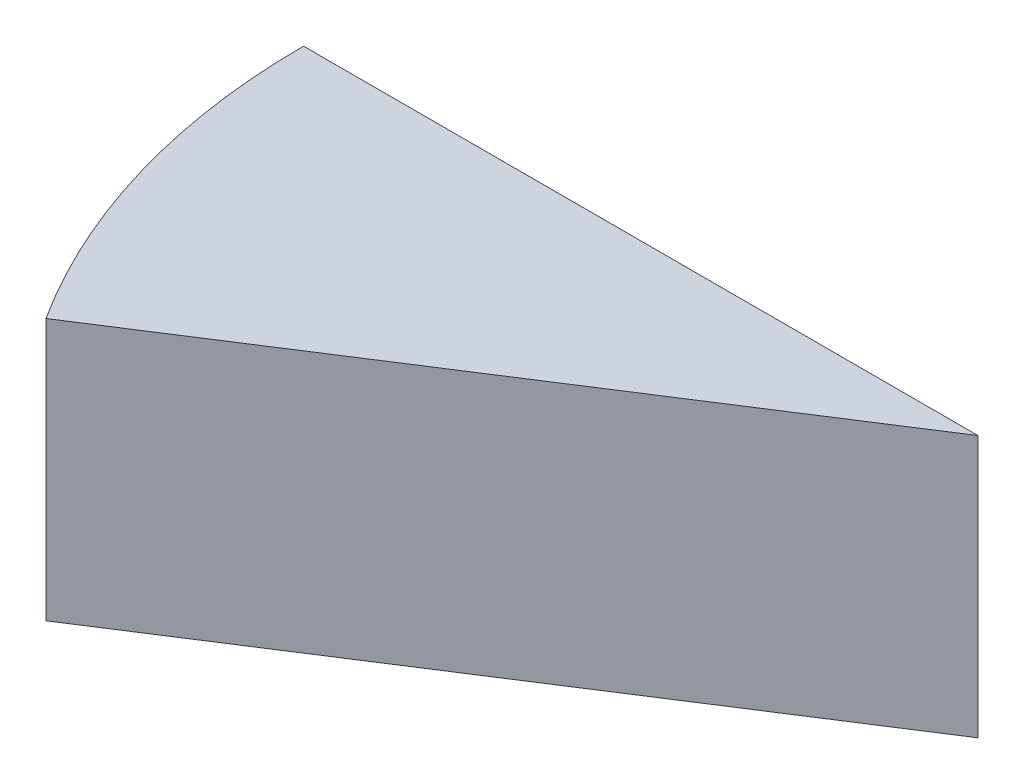
ISO-10303-21;
HEADER;
FILE_DESCRIPTION(('STEP AP214'),'2;1');
FILE_NAME('part.step','',(''),(''),'','','');
FILE_SCHEMA(('AUTOMOTIVE_DESIGN { 1 0 10303 214 1 1 1 1 }'));
ENDSEC;
DATA;
#1=APPLICATION_CONTEXT('core data for automotive mechanical design processes');
#2=APPLICATION_PROTOCOL_DEFINITION('international standard','automotive_design',2000,#1);
#3=PRODUCT_CONTEXT('',#1,'mechanical');
#4=PRODUCT('Part','Part','',(#3));
#5=PRODUCT_RELATED_PRODUCT_CATEGORY('part','',(#4));
#6=PRODUCT_DEFINITION_FORMATION('','',#4);
#7=PRODUCT_DEFINITION_CONTEXT('part definition',#1,'design');
#8=PRODUCT_DEFINITION('design','',#6,#7);
#9=PRODUCT_DEFINITION_SHAPE('','',#8);
#10=(LENGTH_UNIT() NAMED_UNIT(*) SI_UNIT(.MILLI.,.METRE.));
#11=(NAMED_UNIT(*) PLANE_ANGLE_UNIT() SI_UNIT($,.RADIAN.));
#12=(NAMED_UNIT(*) SI_UNIT($,.STERADIAN.) SOLID_ANGLE_UNIT());
#13=UNCERTAINTY_MEASURE_WITH_UNIT(LENGTH_MEASURE(1.E-05),#10,'distance_accuracy_value','');
#14=(GEOMETRIC_REPRESENTATION_CONTEXT(3) GLOBAL_UNCERTAINTY_ASSIGNED_CONTEXT((#13)) GLOBAL_UNIT_ASSIGNED_CONTEXT((#10,
#11,#12)) REPRESENTATION_CONTEXT('',''));
#15=CARTESIAN_POINT('',(0.,0.,0.));
#16=DIRECTION('',(0.,0.,1.));
#17=DIRECTION('',(1.,0.,0.));
#18=AXIS2_PLACEMENT_3D('',#15,#16,#17);
#19=CARTESIAN_POINT('',(0.,30.,0.));
#20=DIRECTION('',(0.,0.,-1.));
#21=DIRECTION('',(-1.,0.,0.));
#22=AXIS2_PLACEMENT_3D('',#19,#20,#21);
#23=PLANE('',#22);
#24=DIRECTION('',(1.,0.,0.));
#25=VECTOR('',#24,1.);
#26=CARTESIAN_POINT('',(0.,0.,0.));
#27=LINE('',#26,#25);
#28=CARTESIAN_POINT('',(-77.2828550105163,0.,0.));
#29=VERTEX_POINT('',#28);
#30=CARTESIAN_POINT('',(0.,0.,0.));
#31=VERTEX_POINT('',#30);
#32=EDGE_CURVE('E78',#29,#31,#27,.T.);
#33=ORIENTED_EDGE('',*,*,#32,.F.);
#34=DIRECTION('',(0.,-1.,0.));
#35=VECTOR('',#34,1.);
#36=CARTESIAN_POINT('',(-77.2828550105163,30.,0.));
#37=LINE('',#36,#35);
#38=CARTESIAN_POINT('',(-77.2828550105163,30.,0.));
#39=VERTEX_POINT('',#38);
#40=EDGE_CURVE('E11',#39,#29,#37,.T.);
#41=ORIENTED_EDGE('',*,*,#40,.F.);
#42=DIRECTION('',(1.,0.,0.));
#43=VECTOR('',#42,1.);
#44=CARTESIAN_POINT('',(0.,30.,0.));
#45=LINE('',#44,#43);
#46=CARTESIAN_POINT('',(0.,30.,0.));
#47=VERTEX_POINT('',#46);
#48=EDGE_CURVE('E76',#39,#47,#45,.T.);
#49=ORIENTED_EDGE('',*,*,#48,.T.);
#50=DIRECTION('',(0.,-1.,0.));
#51=VECTOR('',#50,1.);
#52=CARTESIAN_POINT('',(0.,30.,0.));
#53=LINE('',#52,#51);
#54=EDGE_CURVE('E58',#47,#31,#53,.T.);
#55=ORIENTED_EDGE('',*,*,#54,.T.);
#56=EDGE_LOOP('',(#33,#41,#49,#55));
#57=FACE_BOUND('',#56,.T.);
#58=ADVANCED_FACE('F41',(#57),#23,.T.);
#59=CARTESIAN_POINT('',(0.,30.,0.));
#60=DIRECTION('',(0.,-1.,0.));
#61=DIRECTION('',(0.,0.,-1.));
#62=AXIS2_PLACEMENT_3D('',#59,#60,#61);
#63=CYLINDRICAL_SURFACE('',#62,77.2828550105163);
#64=CARTESIAN_POINT('',(0.,0.,0.));
#65=DIRECTION('',(0.,1.,0.));
#66=DIRECTION('',(0.,0.,1.));
#67=AXIS2_PLACEMENT_3D('',#64,#65,#66);
#68=CIRCLE('',#67,77.2828550105163);
#69=CARTESIAN_POINT('',(-65.014474804877,0.,41.7822659081876));
#70=VERTEX_POINT('',#69);
#71=EDGE_CURVE('E93',#29,#70,#68,.T.);
#72=ORIENTED_EDGE('',*,*,#71,.T.);
#73=DIRECTION('',(0.,-1.,0.));
#74=VECTOR('',#73,1.);
#75=CARTESIAN_POINT('',(-65.014474804877,30.,41.7822659081876));
#76=LINE('',#75,#74);
#77=CARTESIAN_POINT('',(-65.014474804877,30.,41.7822659081876));
#78=VERTEX_POINT('',#77);
#79=EDGE_CURVE('E50',#78,#70,#76,.T.);
#80=ORIENTED_EDGE('',*,*,#79,.F.);
#81=CARTESIAN_POINT('',(0.,30.,0.));
#82=DIRECTION('',(0.,1.,0.));
#83=DIRECTION('',(0.,0.,1.));
#84=AXIS2_PLACEMENT_3D('',#81,#82,#83);
#85=CIRCLE('',#84,77.2828550105163);
#86=EDGE_CURVE('E81',#39,#78,#85,.T.);
#87=ORIENTED_EDGE('',*,*,#86,.F.);
#88=ORIENTED_EDGE('',*,*,#40,.T.);
#89=EDGE_LOOP('',(#72,#80,#87,#88));
#90=FACE_BOUND('',#89,.T.);
#91=ADVANCED_FACE('F82',(#90),#63,.T.);
#92=CARTESIAN_POINT('',(0.,30.,0.));
#93=DIRECTION('',(0.540640817455593,0.,0.841253532831184));
#94=DIRECTION('',(0.841253532831184,0.,-0.540640817455593));
#95=AXIS2_PLACEMENT_3D('',#92,#93,#94);
#96=PLANE('',#95);
#97=DIRECTION('',(-0.841253532831184,0.,0.540640817455593));
#98=VECTOR('',#97,1.);
#99=CARTESIAN_POINT('',(0.,0.,0.));
#100=LINE('',#99,#98);
#101=EDGE_CURVE('E89',#31,#70,#100,.T.);
#102=ORIENTED_EDGE('',*,*,#101,.F.);
#103=ORIENTED_EDGE('',*,*,#54,.F.);
#104=DIRECTION('',(-0.841253532831184,0.,0.540640817455593));
#105=VECTOR('',#104,1.);
#106=CARTESIAN_POINT('',(0.,30.,0.));
#107=LINE('',#106,#105);
#108=EDGE_CURVE('E85',#47,#78,#107,.T.);
#109=ORIENTED_EDGE('',*,*,#108,.T.);
#110=ORIENTED_EDGE('',*,*,#79,.T.);
#111=EDGE_LOOP('',(#102,#103,#109,#110));
#112=FACE_BOUND('',#111,.T.);
#113=ADVANCED_FACE('F106',(#112),#96,.T.);
#114=CARTESIAN_POINT('',(0.,30.,0.));
#115=DIRECTION('',(0.,1.,0.));
#116=DIRECTION('',(0.,0.,1.));
#117=AXIS2_PLACEMENT_3D('',#114,#115,#116);
#118=PLANE('',#117);
#119=ORIENTED_EDGE('',*,*,#48,.F.);
#120=ORIENTED_EDGE('',*,*,#86,.T.);
#121=ORIENTED_EDGE('',*,*,#108,.F.);
#122=EDGE_LOOP('',(#119,#120,#121));
#123=FACE_BOUND('',#122,.T.);
#124=ADVANCED_FACE('F87',(#123),#118,.T.);
#125=CARTESIAN_POINT('',(0.,0.,0.));
#126=DIRECTION('',(0.,1.,0.));
#127=DIRECTION('',(0.,0.,1.));
#128=AXIS2_PLACEMENT_3D('',#125,#126,#127);
#129=PLANE('',#128);
#130=ORIENTED_EDGE('',*,*,#32,.T.);
#131=ORIENTED_EDGE('',*,*,#101,.T.);
#132=ORIENTED_EDGE('',*,*,#71,.F.);
#133=EDGE_LOOP('',(#130,#131,#132));
#134=FACE_BOUND('',#133,.T.);
#135=ADVANCED_FACE('F105',(#134),#129,.F.);
#136=CLOSED_SHELL('',(#58,#91,#113,#124,#135));
#137=MANIFOLD_SOLID_BREP('B2',#136);
#138=ADVANCED_BREP_SHAPE_REPRESENTATION('',(#18,#137),#14);
#139=SHAPE_DEFINITION_REPRESENTATION(#9,#138);
ENDSEC;
END-ISO-10303-21;
